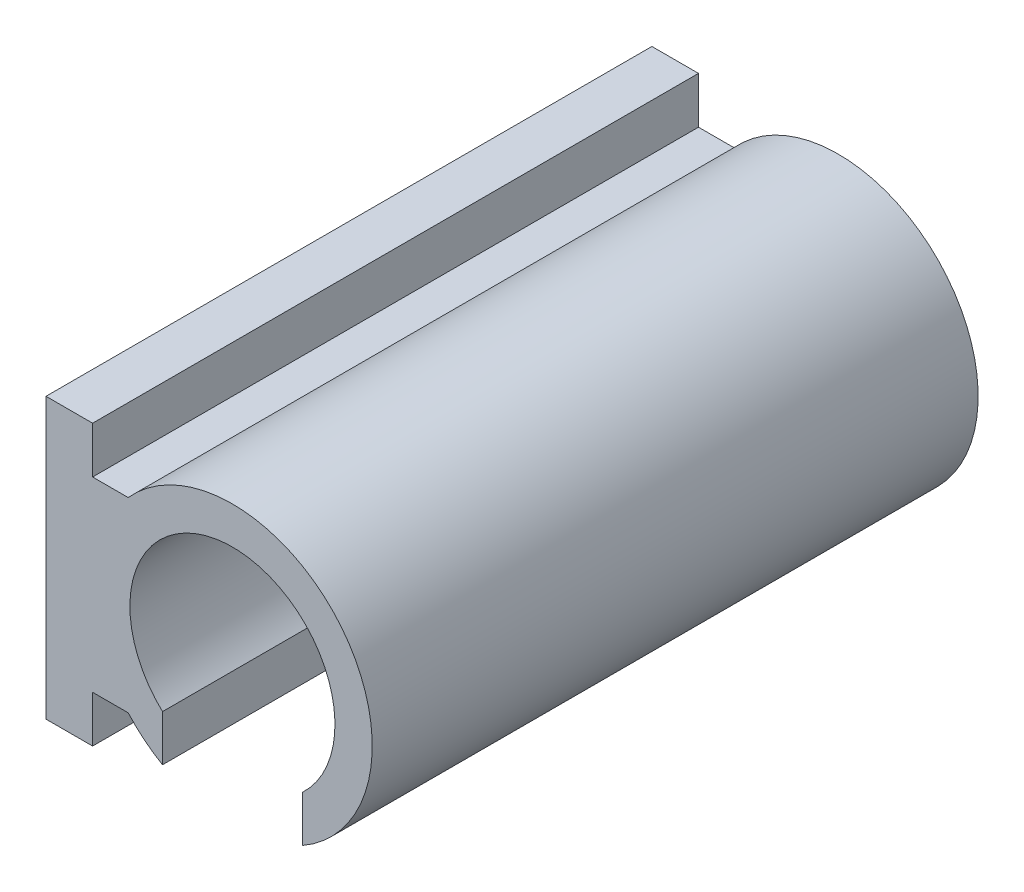
ISO-10303-21;
HEADER;
FILE_DESCRIPTION(('STEP AP214'),'2;1');
FILE_NAME('part.step','',(''),(''),'','','');
FILE_SCHEMA(('AUTOMOTIVE_DESIGN { 1 0 10303 214 1 1 1 1 }'));
ENDSEC;
DATA;
#1=APPLICATION_CONTEXT('core data for automotive mechanical design processes');
#2=APPLICATION_PROTOCOL_DEFINITION('international standard','automotive_design',2000,#1);
#3=PRODUCT_CONTEXT('',#1,'mechanical');
#4=PRODUCT('Part','Part','',(#3));
#5=PRODUCT_RELATED_PRODUCT_CATEGORY('part','',(#4));
#6=PRODUCT_DEFINITION_FORMATION('','',#4);
#7=PRODUCT_DEFINITION_CONTEXT('part definition',#1,'design');
#8=PRODUCT_DEFINITION('design','',#6,#7);
#9=PRODUCT_DEFINITION_SHAPE('','',#8);
#10=(LENGTH_UNIT() NAMED_UNIT(*) SI_UNIT(.MILLI.,.METRE.));
#11=(NAMED_UNIT(*) PLANE_ANGLE_UNIT() SI_UNIT($,.RADIAN.));
#12=(NAMED_UNIT(*) SI_UNIT($,.STERADIAN.) SOLID_ANGLE_UNIT());
#13=UNCERTAINTY_MEASURE_WITH_UNIT(LENGTH_MEASURE(1.E-05),#10,'distance_accuracy_value','');
#14=(GEOMETRIC_REPRESENTATION_CONTEXT(3) GLOBAL_UNCERTAINTY_ASSIGNED_CONTEXT((#13)) GLOBAL_UNIT_ASSIGNED_CONTEXT((#10,
#11,#12)) REPRESENTATION_CONTEXT('',''));
#15=CARTESIAN_POINT('',(0.,0.,0.));
#16=DIRECTION('',(0.,0.,1.));
#17=DIRECTION('',(1.,0.,0.));
#18=AXIS2_PLACEMENT_3D('',#15,#16,#17);
#19=CARTESIAN_POINT('',(0.,0.,130.));
#20=DIRECTION('',(0.,0.,-1.));
#21=DIRECTION('',(-1.,0.,0.));
#22=AXIS2_PLACEMENT_3D('',#19,#20,#21);
#23=CYLINDRICAL_SURFACE('',#22,30.);
#24=DIRECTION('',(0.,0.,-1.));
#25=VECTOR('',#24,1.);
#26=CARTESIAN_POINT('',(-22.3606797749979,20.,130.));
#27=LINE('',#26,#25);
#28=CARTESIAN_POINT('',(-22.3606797749979,20.,0.));
#29=VERTEX_POINT('',#28);
#30=CARTESIAN_POINT('',(-22.3606797749979,20.,130.));
#31=VERTEX_POINT('',#30);
#32=EDGE_CURVE('E49',#29,#31,#27,.F.);
#33=ORIENTED_EDGE('',*,*,#32,.T.);
#34=CARTESIAN_POINT('',(0.,0.,130.));
#35=DIRECTION('',(0.,0.,1.));
#36=DIRECTION('',(1.,0.,0.));
#37=AXIS2_PLACEMENT_3D('',#34,#35,#36);
#38=CIRCLE('',#37,30.);
#39=CARTESIAN_POINT('',(15.,-25.9807621135332,130.));
#40=VERTEX_POINT('',#39);
#41=EDGE_CURVE('E11',#40,#31,#38,.T.);
#42=ORIENTED_EDGE('',*,*,#41,.F.);
#43=DIRECTION('',(0.,0.,-1.));
#44=VECTOR('',#43,1.);
#45=CARTESIAN_POINT('',(15.,-25.9807621135332,130.));
#46=LINE('',#45,#44);
#47=CARTESIAN_POINT('',(15.,-25.9807621135332,0.));
#48=VERTEX_POINT('',#47);
#49=EDGE_CURVE('E181',#40,#48,#46,.T.);
#50=ORIENTED_EDGE('',*,*,#49,.T.);
#51=CARTESIAN_POINT('',(0.,0.,0.));
#52=DIRECTION('',(0.,0.,1.));
#53=DIRECTION('',(1.,0.,0.));
#54=AXIS2_PLACEMENT_3D('',#51,#52,#53);
#55=CIRCLE('',#54,30.);
#56=EDGE_CURVE('E37',#48,#29,#55,.T.);
#57=ORIENTED_EDGE('',*,*,#56,.T.);
#58=EDGE_LOOP('',(#33,#42,#50,#57));
#59=FACE_BOUND('',#58,.T.);
#60=ADVANCED_FACE('F33',(#59),#23,.T.);
#61=DIRECTION('',(0.,0.,-1.));
#62=VECTOR('',#61,1.);
#63=CARTESIAN_POINT('',(-22.3606797749979,-20.,130.));
#64=LINE('',#63,#62);
#65=CARTESIAN_POINT('',(-22.3606797749979,-20.,130.));
#66=VERTEX_POINT('',#65);
#67=CARTESIAN_POINT('',(-22.3606797749979,-20.,0.));
#68=VERTEX_POINT('',#67);
#69=EDGE_CURVE('E160',#66,#68,#64,.T.);
#70=ORIENTED_EDGE('',*,*,#69,.T.);
#71=CARTESIAN_POINT('',(-15.,-25.9807621135332,0.));
#72=VERTEX_POINT('',#71);
#73=EDGE_CURVE('E197',#68,#72,#55,.T.);
#74=ORIENTED_EDGE('',*,*,#73,.T.);
#75=DIRECTION('',(0.,0.,-1.));
#76=VECTOR('',#75,1.);
#77=CARTESIAN_POINT('',(-15.,-25.9807621135332,130.));
#78=LINE('',#77,#76);
#79=CARTESIAN_POINT('',(-15.,-25.9807621135332,130.));
#80=VERTEX_POINT('',#79);
#81=EDGE_CURVE('E178',#72,#80,#78,.F.);
#82=ORIENTED_EDGE('',*,*,#81,.T.);
#83=EDGE_CURVE('E42',#66,#80,#38,.T.);
#84=ORIENTED_EDGE('',*,*,#83,.F.);
#85=EDGE_LOOP('',(#70,#74,#82,#84));
#86=FACE_BOUND('',#85,.T.);
#87=ADVANCED_FACE('F35',(#86),#23,.T.);
#88=CARTESIAN_POINT('',(0.,0.,130.));
#89=DIRECTION('',(0.,0.,1.));
#90=DIRECTION('',(1.,0.,0.));
#91=AXIS2_PLACEMENT_3D('',#88,#89,#90);
#92=PLANE('',#91);
#93=ORIENTED_EDGE('',*,*,#41,.T.);
#94=DIRECTION('',(-1.,0.,0.));
#95=VECTOR('',#94,1.);
#96=CARTESIAN_POINT('',(30.002,20.,130.));
#97=LINE('',#96,#95);
#98=CARTESIAN_POINT('',(-30.,20.,130.));
#99=VERTEX_POINT('',#98);
#100=EDGE_CURVE('E156',#31,#99,#97,.T.);
#101=ORIENTED_EDGE('',*,*,#100,.T.);
#102=DIRECTION('',(0.,1.,0.));
#103=VECTOR('',#102,1.);
#104=CARTESIAN_POINT('',(-30.,-30.,130.));
#105=LINE('',#104,#103);
#106=CARTESIAN_POINT('',(-30.,30.,130.));
#107=VERTEX_POINT('',#106);
#108=EDGE_CURVE('E227',#99,#107,#105,.T.);
#109=ORIENTED_EDGE('',*,*,#108,.T.);
#110=DIRECTION('',(1.,0.,0.));
#111=VECTOR('',#110,1.);
#112=CARTESIAN_POINT('',(-40.,30.,130.));
#113=LINE('',#112,#111);
#114=CARTESIAN_POINT('',(-40.,30.,130.));
#115=VERTEX_POINT('',#114);
#116=EDGE_CURVE('E150',#115,#107,#113,.T.);
#117=ORIENTED_EDGE('',*,*,#116,.F.);
#118=DIRECTION('',(0.,1.,0.));
#119=VECTOR('',#118,1.);
#120=CARTESIAN_POINT('',(-40.,-30.,130.));
#121=LINE('',#120,#119);
#122=CARTESIAN_POINT('',(-40.,-30.,130.));
#123=VERTEX_POINT('',#122);
#124=EDGE_CURVE('E130',#123,#115,#121,.T.);
#125=ORIENTED_EDGE('',*,*,#124,.F.);
#126=DIRECTION('',(1.,0.,0.));
#127=VECTOR('',#126,1.);
#128=CARTESIAN_POINT('',(-40.,-30.,130.));
#129=LINE('',#128,#127);
#130=CARTESIAN_POINT('',(-30.,-30.,130.));
#131=VERTEX_POINT('',#130);
#132=EDGE_CURVE('E127',#123,#131,#129,.T.);
#133=ORIENTED_EDGE('',*,*,#132,.T.);
#134=CARTESIAN_POINT('',(-30.,-20.,130.));
#135=VERTEX_POINT('',#134);
#136=EDGE_CURVE('E235',#131,#135,#105,.T.);
#137=ORIENTED_EDGE('',*,*,#136,.T.);
#138=DIRECTION('',(-1.,0.,0.));
#139=VECTOR('',#138,1.);
#140=CARTESIAN_POINT('',(30.002,-20.,130.));
#141=LINE('',#140,#139);
#142=EDGE_CURVE('E170',#66,#135,#141,.T.);
#143=ORIENTED_EDGE('',*,*,#142,.F.);
#144=ORIENTED_EDGE('',*,*,#83,.T.);
#145=DIRECTION('',(0.,-1.,0.));
#146=VECTOR('',#145,1.);
#147=CARTESIAN_POINT('',(-15.,30.001,130.));
#148=LINE('',#147,#146);
#149=CARTESIAN_POINT('',(-15.,-16.0934769394311,130.));
#150=VERTEX_POINT('',#149);
#151=EDGE_CURVE('E166',#150,#80,#148,.T.);
#152=ORIENTED_EDGE('',*,*,#151,.F.);
#153=CARTESIAN_POINT('',(0.,0.,130.));
#154=DIRECTION('',(0.,0.,1.));
#155=DIRECTION('',(1.,0.,0.));
#156=AXIS2_PLACEMENT_3D('',#153,#154,#155);
#157=CIRCLE('',#156,22.);
#158=CARTESIAN_POINT('',(15.,-16.0934769394311,130.));
#159=VERTEX_POINT('',#158);
#160=EDGE_CURVE('E193',#159,#150,#157,.T.);
#161=ORIENTED_EDGE('',*,*,#160,.F.);
#162=DIRECTION('',(0.,1.,0.));
#163=VECTOR('',#162,1.);
#164=CARTESIAN_POINT('',(15.,30.001,130.));
#165=LINE('',#164,#163);
#166=EDGE_CURVE('E176',#40,#159,#165,.T.);
#167=ORIENTED_EDGE('',*,*,#166,.F.);
#168=EDGE_LOOP('',(#93,#101,#109,#117,#125,#133,#137,#143,#144,#152,#161,#167));
#169=FACE_BOUND('',#168,.T.);
#170=ADVANCED_FACE('F206',(#169),#92,.T.);
#171=CARTESIAN_POINT('',(0.,0.,0.));
#172=DIRECTION('',(0.,0.,1.));
#173=DIRECTION('',(1.,0.,0.));
#174=AXIS2_PLACEMENT_3D('',#171,#172,#173);
#175=PLANE('',#174);
#176=DIRECTION('',(0.,-1.,0.));
#177=VECTOR('',#176,1.);
#178=CARTESIAN_POINT('',(-15.,30.001,0.));
#179=LINE('',#178,#177);
#180=CARTESIAN_POINT('',(-15.,-16.0934769394311,0.));
#181=VERTEX_POINT('',#180);
#182=EDGE_CURVE('E186',#181,#72,#179,.T.);
#183=ORIENTED_EDGE('',*,*,#182,.T.);
#184=ORIENTED_EDGE('',*,*,#73,.F.);
#185=DIRECTION('',(-1.,0.,0.));
#186=VECTOR('',#185,1.);
#187=CARTESIAN_POINT('',(30.002,-20.,0.));
#188=LINE('',#187,#186);
#189=CARTESIAN_POINT('',(-30.,-20.,0.));
#190=VERTEX_POINT('',#189);
#191=EDGE_CURVE('E167',#68,#190,#188,.T.);
#192=ORIENTED_EDGE('',*,*,#191,.T.);
#193=DIRECTION('',(0.,-1.,0.));
#194=VECTOR('',#193,1.);
#195=CARTESIAN_POINT('',(-30.,-30.,0.));
#196=LINE('',#195,#194);
#197=CARTESIAN_POINT('',(-30.,-30.,0.));
#198=VERTEX_POINT('',#197);
#199=EDGE_CURVE('E145',#190,#198,#196,.T.);
#200=ORIENTED_EDGE('',*,*,#199,.T.);
#201=DIRECTION('',(1.,0.,0.));
#202=VECTOR('',#201,1.);
#203=CARTESIAN_POINT('',(-40.,-30.,0.));
#204=LINE('',#203,#202);
#205=CARTESIAN_POINT('',(-40.,-30.,0.));
#206=VERTEX_POINT('',#205);
#207=EDGE_CURVE('E125',#206,#198,#204,.T.);
#208=ORIENTED_EDGE('',*,*,#207,.F.);
#209=DIRECTION('',(0.,-1.,0.));
#210=VECTOR('',#209,1.);
#211=CARTESIAN_POINT('',(-40.,-30.,0.));
#212=LINE('',#211,#210);
#213=CARTESIAN_POINT('',(-40.,30.,0.));
#214=VERTEX_POINT('',#213);
#215=EDGE_CURVE('E131',#214,#206,#212,.T.);
#216=ORIENTED_EDGE('',*,*,#215,.F.);
#217=DIRECTION('',(1.,0.,0.));
#218=VECTOR('',#217,1.);
#219=CARTESIAN_POINT('',(-40.,30.,0.));
#220=LINE('',#219,#218);
#221=CARTESIAN_POINT('',(-30.,30.,0.));
#222=VERTEX_POINT('',#221);
#223=EDGE_CURVE('E228',#214,#222,#220,.T.);
#224=ORIENTED_EDGE('',*,*,#223,.T.);
#225=CARTESIAN_POINT('',(-30.,20.,0.));
#226=VERTEX_POINT('',#225);
#227=EDGE_CURVE('E226',#222,#226,#196,.T.);
#228=ORIENTED_EDGE('',*,*,#227,.T.);
#229=DIRECTION('',(-1.,0.,0.));
#230=VECTOR('',#229,1.);
#231=CARTESIAN_POINT('',(30.002,20.,0.));
#232=LINE('',#231,#230);
#233=EDGE_CURVE('E148',#29,#226,#232,.T.);
#234=ORIENTED_EDGE('',*,*,#233,.F.);
#235=ORIENTED_EDGE('',*,*,#56,.F.);
#236=DIRECTION('',(0.,-1.,0.));
#237=VECTOR('',#236,1.);
#238=CARTESIAN_POINT('',(15.,30.001,0.));
#239=LINE('',#238,#237);
#240=CARTESIAN_POINT('',(15.,-16.0934769394311,0.));
#241=VERTEX_POINT('',#240);
#242=EDGE_CURVE('E188',#241,#48,#239,.T.);
#243=ORIENTED_EDGE('',*,*,#242,.F.);
#244=CARTESIAN_POINT('',(0.,0.,0.));
#245=DIRECTION('',(0.,0.,1.));
#246=DIRECTION('',(1.,0.,0.));
#247=AXIS2_PLACEMENT_3D('',#244,#245,#246);
#248=CIRCLE('',#247,22.);
#249=EDGE_CURVE('E194',#241,#181,#248,.T.);
#250=ORIENTED_EDGE('',*,*,#249,.T.);
#251=EDGE_LOOP('',(#183,#184,#192,#200,#208,#216,#224,#228,#234,#235,#243,#250));
#252=FACE_BOUND('',#251,.T.);
#253=ADVANCED_FACE('F143',(#252),#175,.F.);
#254=CARTESIAN_POINT('',(0.,0.,0.));
#255=DIRECTION('',(0.,0.,1.));
#256=DIRECTION('',(1.,0.,0.));
#257=AXIS2_PLACEMENT_3D('',#254,#255,#256);
#258=CYLINDRICAL_SURFACE('',#257,22.);
#259=DIRECTION('',(0.,0.,1.));
#260=VECTOR('',#259,1.);
#261=CARTESIAN_POINT('',(-15.,-16.0934769394311,0.));
#262=LINE('',#261,#260);
#263=EDGE_CURVE('E190',#150,#181,#262,.F.);
#264=ORIENTED_EDGE('',*,*,#263,.T.);
#265=ORIENTED_EDGE('',*,*,#249,.F.);
#266=DIRECTION('',(0.,0.,1.));
#267=VECTOR('',#266,1.);
#268=CARTESIAN_POINT('',(15.,-16.0934769394311,0.));
#269=LINE('',#268,#267);
#270=EDGE_CURVE('E183',#241,#159,#269,.T.);
#271=ORIENTED_EDGE('',*,*,#270,.T.);
#272=ORIENTED_EDGE('',*,*,#160,.T.);
#273=EDGE_LOOP('',(#264,#265,#271,#272));
#274=FACE_BOUND('',#273,.T.);
#275=ADVANCED_FACE('F201',(#274),#258,.F.);
#276=CARTESIAN_POINT('',(15.,30.001,140.));
#277=DIRECTION('',(-1.,0.,0.));
#278=DIRECTION('',(0.,0.,1.));
#279=AXIS2_PLACEMENT_3D('',#276,#277,#278);
#280=PLANE('',#279);
#281=ORIENTED_EDGE('',*,*,#166,.T.);
#282=ORIENTED_EDGE('',*,*,#270,.F.);
#283=ORIENTED_EDGE('',*,*,#242,.T.);
#284=ORIENTED_EDGE('',*,*,#49,.F.);
#285=EDGE_LOOP('',(#281,#282,#283,#284));
#286=FACE_BOUND('',#285,.T.);
#287=ADVANCED_FACE('F217',(#286),#280,.T.);
#288=CARTESIAN_POINT('',(-15.,30.001,140.));
#289=DIRECTION('',(1.,0.,0.));
#290=DIRECTION('',(0.,0.,-1.));
#291=AXIS2_PLACEMENT_3D('',#288,#289,#290);
#292=PLANE('',#291);
#293=ORIENTED_EDGE('',*,*,#182,.F.);
#294=ORIENTED_EDGE('',*,*,#263,.F.);
#295=ORIENTED_EDGE('',*,*,#151,.T.);
#296=ORIENTED_EDGE('',*,*,#81,.F.);
#297=EDGE_LOOP('',(#293,#294,#295,#296));
#298=FACE_BOUND('',#297,.T.);
#299=ADVANCED_FACE('F210',(#298),#292,.T.);
#300=CARTESIAN_POINT('',(30.002,-20.,130.));
#301=DIRECTION('',(0.,1.,0.));
#302=DIRECTION('',(0.,0.,1.));
#303=AXIS2_PLACEMENT_3D('',#300,#301,#302);
#304=PLANE('',#303);
#305=ORIENTED_EDGE('',*,*,#69,.F.);
#306=ORIENTED_EDGE('',*,*,#142,.T.);
#307=DIRECTION('',(0.,0.,-1.));
#308=VECTOR('',#307,1.);
#309=CARTESIAN_POINT('',(-30.,-20.,130.));
#310=LINE('',#309,#308);
#311=EDGE_CURVE('E163',#135,#190,#310,.T.);
#312=ORIENTED_EDGE('',*,*,#311,.T.);
#313=ORIENTED_EDGE('',*,*,#191,.F.);
#314=EDGE_LOOP('',(#305,#306,#312,#313));
#315=FACE_BOUND('',#314,.T.);
#316=ADVANCED_FACE('F247',(#315),#304,.F.);
#317=CARTESIAN_POINT('',(30.002,20.,130.));
#318=DIRECTION('',(0.,-1.,0.));
#319=DIRECTION('',(0.,0.,-1.));
#320=AXIS2_PLACEMENT_3D('',#317,#318,#319);
#321=PLANE('',#320);
#322=ORIENTED_EDGE('',*,*,#32,.F.);
#323=ORIENTED_EDGE('',*,*,#233,.T.);
#324=DIRECTION('',(0.,0.,1.));
#325=VECTOR('',#324,1.);
#326=CARTESIAN_POINT('',(-30.,20.,130.));
#327=LINE('',#326,#325);
#328=EDGE_CURVE('E154',#226,#99,#327,.T.);
#329=ORIENTED_EDGE('',*,*,#328,.T.);
#330=ORIENTED_EDGE('',*,*,#100,.F.);
#331=EDGE_LOOP('',(#322,#323,#329,#330));
#332=FACE_BOUND('',#331,.T.);
#333=ADVANCED_FACE('F220',(#332),#321,.F.);
#334=CARTESIAN_POINT('',(-30.,0.,0.));
#335=DIRECTION('',(1.,0.,0.));
#336=DIRECTION('',(0.,0.,-1.));
#337=AXIS2_PLACEMENT_3D('',#334,#335,#336);
#338=PLANE('',#337);
#339=ORIENTED_EDGE('',*,*,#328,.F.);
#340=ORIENTED_EDGE('',*,*,#227,.F.);
#341=DIRECTION('',(0.,0.,-1.));
#342=VECTOR('',#341,1.);
#343=CARTESIAN_POINT('',(-30.,30.,0.));
#344=LINE('',#343,#342);
#345=EDGE_CURVE('E140',#107,#222,#344,.T.);
#346=ORIENTED_EDGE('',*,*,#345,.F.);
#347=ORIENTED_EDGE('',*,*,#108,.F.);
#348=EDGE_LOOP('',(#339,#340,#346,#347));
#349=FACE_BOUND('',#348,.T.);
#350=ADVANCED_FACE('F224',(#349),#338,.T.);
#351=ORIENTED_EDGE('',*,*,#311,.F.);
#352=ORIENTED_EDGE('',*,*,#136,.F.);
#353=DIRECTION('',(0.,0.,1.));
#354=VECTOR('',#353,1.);
#355=CARTESIAN_POINT('',(-30.,-30.,0.));
#356=LINE('',#355,#354);
#357=EDGE_CURVE('E229',#198,#131,#356,.T.);
#358=ORIENTED_EDGE('',*,*,#357,.F.);
#359=ORIENTED_EDGE('',*,*,#199,.F.);
#360=EDGE_LOOP('',(#351,#352,#358,#359));
#361=FACE_BOUND('',#360,.T.);
#362=ADVANCED_FACE('F245',(#361),#338,.T.);
#363=CARTESIAN_POINT('',(-40.,-30.,0.));
#364=DIRECTION('',(0.,1.,0.));
#365=DIRECTION('',(0.,0.,1.));
#366=AXIS2_PLACEMENT_3D('',#363,#364,#365);
#367=PLANE('',#366);
#368=ORIENTED_EDGE('',*,*,#357,.T.);
#369=ORIENTED_EDGE('',*,*,#132,.F.);
#370=DIRECTION('',(0.,0.,1.));
#371=VECTOR('',#370,1.);
#372=CARTESIAN_POINT('',(-40.,-30.,0.));
#373=LINE('',#372,#371);
#374=EDGE_CURVE('E121',#206,#123,#373,.T.);
#375=ORIENTED_EDGE('',*,*,#374,.F.);
#376=ORIENTED_EDGE('',*,*,#207,.T.);
#377=EDGE_LOOP('',(#368,#369,#375,#376));
#378=FACE_BOUND('',#377,.T.);
#379=ADVANCED_FACE('F123',(#378),#367,.F.);
#380=CARTESIAN_POINT('',(-40.,30.,0.));
#381=DIRECTION('',(0.,-1.,0.));
#382=DIRECTION('',(0.,0.,-1.));
#383=AXIS2_PLACEMENT_3D('',#380,#381,#382);
#384=PLANE('',#383);
#385=ORIENTED_EDGE('',*,*,#345,.T.);
#386=ORIENTED_EDGE('',*,*,#223,.F.);
#387=DIRECTION('',(0.,0.,-1.));
#388=VECTOR('',#387,1.);
#389=CARTESIAN_POINT('',(-40.,30.,0.));
#390=LINE('',#389,#388);
#391=EDGE_CURVE('E136',#115,#214,#390,.T.);
#392=ORIENTED_EDGE('',*,*,#391,.F.);
#393=ORIENTED_EDGE('',*,*,#116,.T.);
#394=EDGE_LOOP('',(#385,#386,#392,#393));
#395=FACE_BOUND('',#394,.T.);
#396=ADVANCED_FACE('F242',(#395),#384,.F.);
#397=CARTESIAN_POINT('',(-40.,0.,0.));
#398=DIRECTION('',(1.,0.,0.));
#399=DIRECTION('',(0.,0.,-1.));
#400=AXIS2_PLACEMENT_3D('',#397,#398,#399);
#401=PLANE('',#400);
#402=ORIENTED_EDGE('',*,*,#215,.T.);
#403=ORIENTED_EDGE('',*,*,#374,.T.);
#404=ORIENTED_EDGE('',*,*,#124,.T.);
#405=ORIENTED_EDGE('',*,*,#391,.T.);
#406=EDGE_LOOP('',(#402,#403,#404,#405));
#407=FACE_BOUND('',#406,.T.);
#408=ADVANCED_FACE('F134',(#407),#401,.F.);
#409=CLOSED_SHELL('',(#60,#87,#170,#253,#275,#287,#299,#316,#333,#350,#362,#379,#396,#408));
#410=MANIFOLD_SOLID_BREP('B2',#409);
#411=ADVANCED_BREP_SHAPE_REPRESENTATION('',(#18,#410),#14);
#412=SHAPE_DEFINITION_REPRESENTATION(#9,#411);
ENDSEC;
END-ISO-10303-21;
